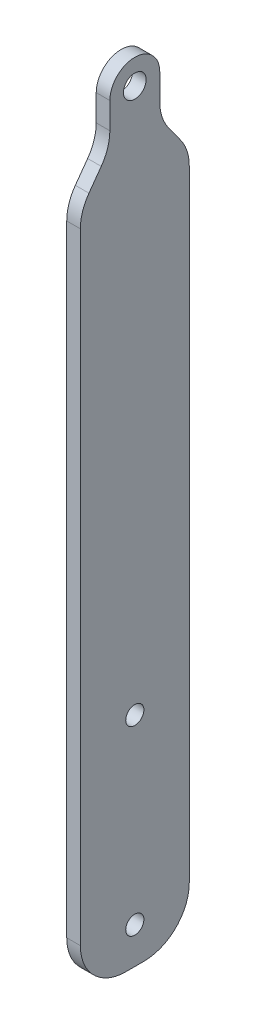
ISO-10303-21;
HEADER;
FILE_DESCRIPTION(('STEP AP214'),'2;1');
FILE_NAME('part.step','',(''),(''),'','','');
FILE_SCHEMA(('AUTOMOTIVE_DESIGN { 1 0 10303 214 1 1 1 1 }'));
ENDSEC;
DATA;
#1=APPLICATION_CONTEXT('core data for automotive mechanical design processes');
#2=APPLICATION_PROTOCOL_DEFINITION('international standard','automotive_design',2000,#1);
#3=PRODUCT_CONTEXT('',#1,'mechanical');
#4=PRODUCT('Part','Part','',(#3));
#5=PRODUCT_RELATED_PRODUCT_CATEGORY('part','',(#4));
#6=PRODUCT_DEFINITION_FORMATION('','',#4);
#7=PRODUCT_DEFINITION_CONTEXT('part definition',#1,'design');
#8=PRODUCT_DEFINITION('design','',#6,#7);
#9=PRODUCT_DEFINITION_SHAPE('','',#8);
#10=(LENGTH_UNIT() NAMED_UNIT(*) SI_UNIT(.MILLI.,.METRE.));
#11=(NAMED_UNIT(*) PLANE_ANGLE_UNIT() SI_UNIT($,.RADIAN.));
#12=(NAMED_UNIT(*) SI_UNIT($,.STERADIAN.) SOLID_ANGLE_UNIT());
#13=UNCERTAINTY_MEASURE_WITH_UNIT(LENGTH_MEASURE(1.E-05),#10,'distance_accuracy_value','');
#14=(GEOMETRIC_REPRESENTATION_CONTEXT(3) GLOBAL_UNCERTAINTY_ASSIGNED_CONTEXT((#13)) GLOBAL_UNIT_ASSIGNED_CONTEXT((#10,
#11,#12)) REPRESENTATION_CONTEXT('',''));
#15=CARTESIAN_POINT('',(0.,0.,0.));
#16=DIRECTION('',(0.,0.,1.));
#17=DIRECTION('',(1.,0.,0.));
#18=AXIS2_PLACEMENT_3D('',#15,#16,#17);
#19=CARTESIAN_POINT('',(21.3,-7.35394608612762,-67.));
#20=DIRECTION('',(-1.,0.,0.));
#21=DIRECTION('',(0.,0.,1.));
#22=AXIS2_PLACEMENT_3D('',#19,#20,#21);
#23=PLANE('',#22);
#24=CARTESIAN_POINT('',(21.3,-127.353946086128,-67.));
#25=DIRECTION('',(-1.,0.,0.));
#26=DIRECTION('',(0.,0.,1.));
#27=AXIS2_PLACEMENT_3D('',#24,#25,#26);
#28=CIRCLE('',#27,2.);
#29=CARTESIAN_POINT('',(21.3,-127.353946086128,-65.));
#30=VERTEX_POINT('',#29);
#31=EDGE_CURVE('E361',#30,#30,#28,.T.);
#32=ORIENTED_EDGE('',*,*,#31,.T.);
#33=EDGE_LOOP('',(#32));
#34=FACE_BOUND('',#33,.T.);
#35=CARTESIAN_POINT('',(21.3,-167.353946086128,-67.));
#36=DIRECTION('',(-1.,0.,0.));
#37=DIRECTION('',(0.,0.,1.));
#38=AXIS2_PLACEMENT_3D('',#35,#36,#37);
#39=CIRCLE('',#38,2.);
#40=CARTESIAN_POINT('',(21.3,-167.353946086128,-65.));
#41=VERTEX_POINT('',#40);
#42=EDGE_CURVE('E369',#41,#41,#39,.T.);
#43=ORIENTED_EDGE('',*,*,#42,.T.);
#44=EDGE_LOOP('',(#43));
#45=FACE_BOUND('',#44,.T.);
#46=DIRECTION('',(0.,0.,-1.));
#47=VECTOR('',#46,1.);
#48=CARTESIAN_POINT('',(21.3,-175.353946086128,-79.));
#49=LINE('',#48,#47);
#50=CARTESIAN_POINT('',(21.3,-175.353946086128,-65.));
#51=VERTEX_POINT('',#50);
#52=CARTESIAN_POINT('',(21.3,-175.353946086128,-69.));
#53=VERTEX_POINT('',#52);
#54=EDGE_CURVE('E208',#51,#53,#49,.T.);
#55=ORIENTED_EDGE('',*,*,#54,.T.);
#56=CARTESIAN_POINT('',(21.3,-165.353946086128,-69.));
#57=DIRECTION('',(-1.,0.,0.));
#58=DIRECTION('',(0.,0.,1.));
#59=AXIS2_PLACEMENT_3D('',#56,#57,#58);
#60=CIRCLE('',#59,10.);
#61=CARTESIAN_POINT('',(21.3,-165.353946086128,-79.));
#62=VERTEX_POINT('',#61);
#63=EDGE_CURVE('E270',#53,#62,#60,.F.);
#64=ORIENTED_EDGE('',*,*,#63,.T.);
#65=DIRECTION('',(0.,1.,0.));
#66=VECTOR('',#65,1.);
#67=CARTESIAN_POINT('',(21.3,-25.3539460861276,-79.));
#68=LINE('',#67,#66);
#69=CARTESIAN_POINT('',(21.3,-28.5874870947234,-79.));
#70=VERTEX_POINT('',#69);
#71=EDGE_CURVE('E211',#62,#70,#68,.T.);
#72=ORIENTED_EDGE('',*,*,#71,.T.);
#73=CARTESIAN_POINT('',(21.3,-28.5874870947234,-69.));
#74=DIRECTION('',(-1.,0.,0.));
#75=DIRECTION('',(0.,0.,1.));
#76=AXIS2_PLACEMENT_3D('',#73,#74,#75);
#77=CIRCLE('',#76,10.);
#78=CARTESIAN_POINT('',(21.3,-22.7325815562798,-77.1067922839988));
#79=VERTEX_POINT('',#78);
#80=EDGE_CURVE('E264',#70,#79,#77,.F.);
#81=ORIENTED_EDGE('',*,*,#80,.T.);
#82=DIRECTION('',(0.,0.810679228399881,0.585490553844358));
#83=VECTOR('',#82,1.);
#84=CARTESIAN_POINT('',(21.3,-16.3539460861276,-72.5));
#85=LINE('',#84,#83);
#86=CARTESIAN_POINT('',(21.3,-18.9753106159754,-74.3932077160012));
#87=VERTEX_POINT('',#86);
#88=EDGE_CURVE('E214',#79,#87,#85,.T.);
#89=ORIENTED_EDGE('',*,*,#88,.T.);
#90=CARTESIAN_POINT('',(21.3,-13.1204050775318,-82.5));
#91=DIRECTION('',(-1.,0.,0.));
#92=DIRECTION('',(0.,0.,1.));
#93=AXIS2_PLACEMENT_3D('',#90,#91,#92);
#94=CIRCLE('',#93,10.);
#95=CARTESIAN_POINT('',(21.3,-13.1204050775318,-72.5));
#96=VERTEX_POINT('',#95);
#97=EDGE_CURVE('E11',#87,#96,#94,.T.);
#98=ORIENTED_EDGE('',*,*,#97,.T.);
#99=DIRECTION('',(0.,1.,0.));
#100=VECTOR('',#99,1.);
#101=CARTESIAN_POINT('',(21.3,-7.35394608612762,-72.5));
#102=LINE('',#101,#100);
#103=CARTESIAN_POINT('',(21.3,-7.35394608612762,-72.5));
#104=VERTEX_POINT('',#103);
#105=EDGE_CURVE('E216',#96,#104,#102,.T.);
#106=ORIENTED_EDGE('',*,*,#105,.T.);
#107=CARTESIAN_POINT('',(21.3,-7.35394608612762,-67.));
#108=DIRECTION('',(1.,0.,0.));
#109=DIRECTION('',(0.,0.,1.));
#110=AXIS2_PLACEMENT_3D('',#107,#108,#109);
#111=CIRCLE('',#110,5.50000000000001);
#112=CARTESIAN_POINT('',(21.3,-7.35394608612762,-61.5));
#113=VERTEX_POINT('',#112);
#114=EDGE_CURVE('E195',#104,#113,#111,.T.);
#115=ORIENTED_EDGE('',*,*,#114,.T.);
#116=DIRECTION('',(0.,-1.,0.));
#117=VECTOR('',#116,1.);
#118=CARTESIAN_POINT('',(21.3,-7.35394608612762,-61.5));
#119=LINE('',#118,#117);
#120=CARTESIAN_POINT('',(21.3,-13.1204050775318,-61.5));
#121=VERTEX_POINT('',#120);
#122=EDGE_CURVE('E198',#113,#121,#119,.T.);
#123=ORIENTED_EDGE('',*,*,#122,.T.);
#124=CARTESIAN_POINT('',(21.3,-13.1204050775318,-51.5));
#125=DIRECTION('',(-1.,0.,0.));
#126=DIRECTION('',(0.,0.,1.));
#127=AXIS2_PLACEMENT_3D('',#124,#125,#126);
#128=CIRCLE('',#127,10.);
#129=CARTESIAN_POINT('',(21.3,-18.9753106159754,-59.6067922839988));
#130=VERTEX_POINT('',#129);
#131=EDGE_CURVE('E295',#121,#130,#128,.T.);
#132=ORIENTED_EDGE('',*,*,#131,.T.);
#133=DIRECTION('',(0.,-0.810679228399881,0.585490553844358));
#134=VECTOR('',#133,1.);
#135=CARTESIAN_POINT('',(21.3,-16.3539460861276,-61.5));
#136=LINE('',#135,#134);
#137=CARTESIAN_POINT('',(21.3,-22.7325815562798,-56.8932077160012));
#138=VERTEX_POINT('',#137);
#139=EDGE_CURVE('E202',#130,#138,#136,.T.);
#140=ORIENTED_EDGE('',*,*,#139,.T.);
#141=CARTESIAN_POINT('',(21.3,-28.5874870947234,-65.));
#142=DIRECTION('',(-1.,0.,0.));
#143=DIRECTION('',(0.,0.,1.));
#144=AXIS2_PLACEMENT_3D('',#141,#142,#143);
#145=CIRCLE('',#144,10.);
#146=CARTESIAN_POINT('',(21.3,-28.5874870947234,-55.));
#147=VERTEX_POINT('',#146);
#148=EDGE_CURVE('E266',#138,#147,#145,.F.);
#149=ORIENTED_EDGE('',*,*,#148,.T.);
#150=DIRECTION('',(0.,-1.,0.));
#151=VECTOR('',#150,1.);
#152=CARTESIAN_POINT('',(21.3,-175.353946086128,-55.));
#153=LINE('',#152,#151);
#154=CARTESIAN_POINT('',(21.3,-165.353946086128,-55.));
#155=VERTEX_POINT('',#154);
#156=EDGE_CURVE('E205',#147,#155,#153,.T.);
#157=ORIENTED_EDGE('',*,*,#156,.T.);
#158=CARTESIAN_POINT('',(21.3,-165.353946086128,-65.));
#159=DIRECTION('',(-1.,0.,0.));
#160=DIRECTION('',(0.,0.,1.));
#161=AXIS2_PLACEMENT_3D('',#158,#159,#160);
#162=CIRCLE('',#161,10.);
#163=EDGE_CURVE('E268',#155,#51,#162,.F.);
#164=ORIENTED_EDGE('',*,*,#163,.T.);
#165=EDGE_LOOP('',(#55,#64,#72,#81,#89,#98,#106,#115,#123,#132,#140,#149,#157,#164));
#166=FACE_BOUND('',#165,.T.);
#167=CARTESIAN_POINT('',(21.3,-7.35394608612762,-67.));
#168=DIRECTION('',(1.,0.,0.));
#169=DIRECTION('',(0.,0.,-1.));
#170=AXIS2_PLACEMENT_3D('',#167,#168,#169);
#171=CIRCLE('',#170,2.5);
#172=CARTESIAN_POINT('',(21.3,-7.35394608612762,-69.5));
#173=VERTEX_POINT('',#172);
#174=EDGE_CURVE('E187',#173,#173,#171,.T.);
#175=ORIENTED_EDGE('',*,*,#174,.F.);
#176=EDGE_LOOP('',(#175));
#177=FACE_BOUND('',#176,.T.);
#178=ADVANCED_FACE('F32',(#34,#45,#166,#177),#23,.F.);
#179=CARTESIAN_POINT('',(18.3,-7.35394608612762,-67.));
#180=DIRECTION('',(-1.,0.,0.));
#181=DIRECTION('',(0.,0.,1.));
#182=AXIS2_PLACEMENT_3D('',#179,#180,#181);
#183=PLANE('',#182);
#184=DIRECTION('',(0.,1.,0.));
#185=VECTOR('',#184,1.);
#186=CARTESIAN_POINT('',(18.3,-25.3539460861276,-79.));
#187=LINE('',#186,#185);
#188=CARTESIAN_POINT('',(18.3,-165.353946086128,-79.));
#189=VERTEX_POINT('',#188);
#190=CARTESIAN_POINT('',(18.3,-28.5874870947234,-79.));
#191=VERTEX_POINT('',#190);
#192=EDGE_CURVE('E230',#189,#191,#187,.T.);
#193=ORIENTED_EDGE('',*,*,#192,.F.);
#194=CARTESIAN_POINT('',(18.3,-165.353946086128,-69.));
#195=DIRECTION('',(-1.,0.,0.));
#196=DIRECTION('',(0.,0.,1.));
#197=AXIS2_PLACEMENT_3D('',#194,#195,#196);
#198=CIRCLE('',#197,10.);
#199=CARTESIAN_POINT('',(18.3,-173.383353838012,-74.9605881550377));
#200=VERTEX_POINT('',#199);
#201=EDGE_CURVE('E252',#189,#200,#198,.T.);
#202=ORIENTED_EDGE('',*,*,#201,.T.);
#203=DIRECTION('',(0.,-0.999800059980007,-0.0199960011996002));
#204=VECTOR('',#203,1.);
#205=CARTESIAN_POINT('',(18.3,-25.3539460861276,-72.));
#206=LINE('',#205,#204);
#207=CARTESIAN_POINT('',(18.3,-25.3539460861276,-72.));
#208=VERTEX_POINT('',#207);
#209=EDGE_CURVE('E359',#208,#200,#206,.T.);
#210=ORIENTED_EDGE('',*,*,#209,.F.);
#211=CARTESIAN_POINT('',(18.3,-25.3539460861276,-67.));
#212=DIRECTION('',(-1.,0.,0.));
#213=DIRECTION('',(0.,0.,-1.));
#214=AXIS2_PLACEMENT_3D('',#211,#212,#213);
#215=CIRCLE('',#214,5.);
#216=CARTESIAN_POINT('',(18.3,-25.3539460861276,-62.));
#217=VERTEX_POINT('',#216);
#218=EDGE_CURVE('E182',#217,#208,#215,.T.);
#219=ORIENTED_EDGE('',*,*,#218,.F.);
#220=DIRECTION('',(0.,0.999800059980007,-0.0199960011996002));
#221=VECTOR('',#220,1.);
#222=CARTESIAN_POINT('',(18.3,-25.3539460861276,-62.));
#223=LINE('',#222,#221);
#224=CARTESIAN_POINT('',(18.3,-173.383353838012,-59.0394118449623));
#225=VERTEX_POINT('',#224);
#226=EDGE_CURVE('E178',#225,#217,#223,.T.);
#227=ORIENTED_EDGE('',*,*,#226,.F.);
#228=CARTESIAN_POINT('',(18.3,-165.353946086128,-65.));
#229=DIRECTION('',(-1.,0.,0.));
#230=DIRECTION('',(0.,0.,1.));
#231=AXIS2_PLACEMENT_3D('',#228,#229,#230);
#232=CIRCLE('',#231,10.);
#233=CARTESIAN_POINT('',(18.3,-165.353946086128,-55.));
#234=VERTEX_POINT('',#233);
#235=EDGE_CURVE('E250',#225,#234,#232,.T.);
#236=ORIENTED_EDGE('',*,*,#235,.T.);
#237=DIRECTION('',(0.,-1.,0.));
#238=VECTOR('',#237,1.);
#239=CARTESIAN_POINT('',(18.3,-175.353946086128,-55.));
#240=LINE('',#239,#238);
#241=CARTESIAN_POINT('',(18.3,-28.5874870947234,-55.));
#242=VERTEX_POINT('',#241);
#243=EDGE_CURVE('E227',#242,#234,#240,.T.);
#244=ORIENTED_EDGE('',*,*,#243,.F.);
#245=CARTESIAN_POINT('',(18.3,-28.5874870947234,-65.));
#246=DIRECTION('',(-1.,0.,0.));
#247=DIRECTION('',(0.,0.,1.));
#248=AXIS2_PLACEMENT_3D('',#245,#246,#247);
#249=CIRCLE('',#248,10.);
#250=CARTESIAN_POINT('',(18.3,-22.7325815562798,-56.8932077160012));
#251=VERTEX_POINT('',#250);
#252=EDGE_CURVE('E248',#242,#251,#249,.T.);
#253=ORIENTED_EDGE('',*,*,#252,.T.);
#254=DIRECTION('',(0.,-0.810679228399881,0.585490553844358));
#255=VECTOR('',#254,1.);
#256=CARTESIAN_POINT('',(18.3,-16.3539460861276,-61.5));
#257=LINE('',#256,#255);
#258=CARTESIAN_POINT('',(18.3,-18.9753106159754,-59.6067922839988));
#259=VERTEX_POINT('',#258);
#260=EDGE_CURVE('E224',#259,#251,#257,.T.);
#261=ORIENTED_EDGE('',*,*,#260,.F.);
#262=CARTESIAN_POINT('',(18.3,-13.1204050775318,-51.5));
#263=DIRECTION('',(-1.,0.,0.));
#264=DIRECTION('',(0.,0.,1.));
#265=AXIS2_PLACEMENT_3D('',#262,#263,#264);
#266=CIRCLE('',#265,10.);
#267=CARTESIAN_POINT('',(18.3,-13.1204050775318,-61.5));
#268=VERTEX_POINT('',#267);
#269=EDGE_CURVE('E293',#259,#268,#266,.F.);
#270=ORIENTED_EDGE('',*,*,#269,.T.);
#271=DIRECTION('',(0.,-1.,0.));
#272=VECTOR('',#271,1.);
#273=CARTESIAN_POINT('',(18.3,-7.35394608612762,-61.5));
#274=LINE('',#273,#272);
#275=CARTESIAN_POINT('',(18.3,-7.35394608612762,-61.5));
#276=VERTEX_POINT('',#275);
#277=EDGE_CURVE('E221',#276,#268,#274,.T.);
#278=ORIENTED_EDGE('',*,*,#277,.F.);
#279=CARTESIAN_POINT('',(18.3,-7.35394608612762,-67.));
#280=DIRECTION('',(1.,0.,0.));
#281=DIRECTION('',(0.,0.,1.));
#282=AXIS2_PLACEMENT_3D('',#279,#280,#281);
#283=CIRCLE('',#282,5.50000000000001);
#284=CARTESIAN_POINT('',(18.3,-7.35394608612762,-72.5));
#285=VERTEX_POINT('',#284);
#286=EDGE_CURVE('E193',#285,#276,#283,.T.);
#287=ORIENTED_EDGE('',*,*,#286,.F.);
#288=DIRECTION('',(0.,1.,0.));
#289=VECTOR('',#288,1.);
#290=CARTESIAN_POINT('',(18.3,-7.35394608612762,-72.5));
#291=LINE('',#290,#289);
#292=CARTESIAN_POINT('',(18.3,-13.1204050775318,-72.5));
#293=VERTEX_POINT('',#292);
#294=EDGE_CURVE('E199',#293,#285,#291,.T.);
#295=ORIENTED_EDGE('',*,*,#294,.F.);
#296=CARTESIAN_POINT('',(18.3,-13.1204050775318,-82.5));
#297=DIRECTION('',(-1.,0.,0.));
#298=DIRECTION('',(0.,0.,1.));
#299=AXIS2_PLACEMENT_3D('',#296,#297,#298);
#300=CIRCLE('',#299,10.);
#301=CARTESIAN_POINT('',(18.3,-18.9753106159754,-74.3932077160012));
#302=VERTEX_POINT('',#301);
#303=EDGE_CURVE('E40',#293,#302,#300,.F.);
#304=ORIENTED_EDGE('',*,*,#303,.T.);
#305=DIRECTION('',(0.,0.810679228399881,0.585490553844358));
#306=VECTOR('',#305,1.);
#307=CARTESIAN_POINT('',(18.3,-16.3539460861276,-72.5));
#308=LINE('',#307,#306);
#309=CARTESIAN_POINT('',(18.3,-22.7325815562798,-77.1067922839988));
#310=VERTEX_POINT('',#309);
#311=EDGE_CURVE('E233',#310,#302,#308,.T.);
#312=ORIENTED_EDGE('',*,*,#311,.F.);
#313=CARTESIAN_POINT('',(18.3,-28.5874870947234,-69.));
#314=DIRECTION('',(-1.,0.,0.));
#315=DIRECTION('',(0.,0.,1.));
#316=AXIS2_PLACEMENT_3D('',#313,#314,#315);
#317=CIRCLE('',#316,10.);
#318=EDGE_CURVE('E246',#310,#191,#317,.T.);
#319=ORIENTED_EDGE('',*,*,#318,.T.);
#320=EDGE_LOOP('',(#193,#202,#210,#219,#227,#236,#244,#253,#261,#270,#278,#287,#295,#304,#312,#319));
#321=FACE_BOUND('',#320,.T.);
#322=CARTESIAN_POINT('',(18.3,-7.35394608612762,-67.));
#323=DIRECTION('',(1.,0.,0.));
#324=DIRECTION('',(0.,0.,-1.));
#325=AXIS2_PLACEMENT_3D('',#322,#323,#324);
#326=CIRCLE('',#325,2.5);
#327=CARTESIAN_POINT('',(18.3,-7.35394608612762,-69.5));
#328=VERTEX_POINT('',#327);
#329=EDGE_CURVE('E183',#328,#328,#326,.T.);
#330=ORIENTED_EDGE('',*,*,#329,.T.);
#331=EDGE_LOOP('',(#330));
#332=FACE_BOUND('',#331,.T.);
#333=ADVANCED_FACE('F300',(#321,#332),#183,.T.);
#334=CARTESIAN_POINT('',(21.3,-7.35394608612762,-67.));
#335=DIRECTION('',(-1.,0.,0.));
#336=DIRECTION('',(0.,0.,1.));
#337=AXIS2_PLACEMENT_3D('',#334,#335,#336);
#338=CYLINDRICAL_SURFACE('',#337,5.50000000000001);
#339=ORIENTED_EDGE('',*,*,#286,.T.);
#340=DIRECTION('',(-1.,0.,0.));
#341=VECTOR('',#340,1.);
#342=CARTESIAN_POINT('',(21.3,-7.35394608612762,-61.5));
#343=LINE('',#342,#341);
#344=EDGE_CURVE('E238',#113,#276,#343,.T.);
#345=ORIENTED_EDGE('',*,*,#344,.F.);
#346=ORIENTED_EDGE('',*,*,#114,.F.);
#347=DIRECTION('',(-1.,0.,0.));
#348=VECTOR('',#347,1.);
#349=CARTESIAN_POINT('',(21.3,-7.35394608612762,-72.5));
#350=LINE('',#349,#348);
#351=EDGE_CURVE('E218',#104,#285,#350,.T.);
#352=ORIENTED_EDGE('',*,*,#351,.T.);
#353=EDGE_LOOP('',(#339,#345,#346,#352));
#354=FACE_BOUND('',#353,.T.);
#355=ADVANCED_FACE('F315',(#354),#338,.T.);
#356=CARTESIAN_POINT('',(21.3,-7.35394608612762,-61.5));
#357=DIRECTION('',(0.,0.,-1.));
#358=DIRECTION('',(-1.,0.,0.));
#359=AXIS2_PLACEMENT_3D('',#356,#357,#358);
#360=PLANE('',#359);
#361=ORIENTED_EDGE('',*,*,#277,.T.);
#362=DIRECTION('',(-1.,0.,0.));
#363=VECTOR('',#362,1.);
#364=CARTESIAN_POINT('',(21.3,-13.1204050775318,-61.5));
#365=LINE('',#364,#363);
#366=EDGE_CURVE('E284',#268,#121,#365,.F.);
#367=ORIENTED_EDGE('',*,*,#366,.T.);
#368=ORIENTED_EDGE('',*,*,#122,.F.);
#369=ORIENTED_EDGE('',*,*,#344,.T.);
#370=EDGE_LOOP('',(#361,#367,#368,#369));
#371=FACE_BOUND('',#370,.T.);
#372=ADVANCED_FACE('F317',(#371),#360,.F.);
#373=CARTESIAN_POINT('',(21.3,-16.3539460861276,-61.5));
#374=DIRECTION('',(0.,-0.585490553844358,-0.810679228399881));
#375=DIRECTION('',(0.,0.810679228399881,-0.585490553844358));
#376=AXIS2_PLACEMENT_3D('',#373,#374,#375);
#377=PLANE('',#376);
#378=ORIENTED_EDGE('',*,*,#260,.T.);
#379=DIRECTION('',(-1.,0.,0.));
#380=VECTOR('',#379,1.);
#381=CARTESIAN_POINT('',(21.3,-22.7325815562798,-56.8932077160012));
#382=LINE('',#381,#380);
#383=EDGE_CURVE('E282',#251,#138,#382,.F.);
#384=ORIENTED_EDGE('',*,*,#383,.T.);
#385=ORIENTED_EDGE('',*,*,#139,.F.);
#386=DIRECTION('',(-1.,0.,0.));
#387=VECTOR('',#386,1.);
#388=CARTESIAN_POINT('',(18.3,-18.9753106159754,-59.6067922839988));
#389=LINE('',#388,#387);
#390=EDGE_CURVE('E279',#130,#259,#389,.T.);
#391=ORIENTED_EDGE('',*,*,#390,.T.);
#392=EDGE_LOOP('',(#378,#384,#385,#391));
#393=FACE_BOUND('',#392,.T.);
#394=ADVANCED_FACE('F325',(#393),#377,.F.);
#395=CARTESIAN_POINT('',(21.3,-175.353946086128,-55.));
#396=DIRECTION('',(0.,0.,-1.));
#397=DIRECTION('',(-1.,0.,0.));
#398=AXIS2_PLACEMENT_3D('',#395,#396,#397);
#399=PLANE('',#398);
#400=ORIENTED_EDGE('',*,*,#243,.T.);
#401=DIRECTION('',(-1.,0.,0.));
#402=VECTOR('',#401,1.);
#403=CARTESIAN_POINT('',(21.3,-165.353946086128,-55.));
#404=LINE('',#403,#402);
#405=EDGE_CURVE('E277',#234,#155,#404,.F.);
#406=ORIENTED_EDGE('',*,*,#405,.T.);
#407=ORIENTED_EDGE('',*,*,#156,.F.);
#408=DIRECTION('',(-1.,0.,0.));
#409=VECTOR('',#408,1.);
#410=CARTESIAN_POINT('',(21.3,-28.5874870947234,-55.));
#411=LINE('',#410,#409);
#412=EDGE_CURVE('E274',#147,#242,#411,.T.);
#413=ORIENTED_EDGE('',*,*,#412,.T.);
#414=EDGE_LOOP('',(#400,#406,#407,#413));
#415=FACE_BOUND('',#414,.T.);
#416=ADVANCED_FACE('F334',(#415),#399,.F.);
#417=CARTESIAN_POINT('',(21.3,-175.353946086128,-79.));
#418=DIRECTION('',(0.,1.,0.));
#419=DIRECTION('',(0.,0.,1.));
#420=AXIS2_PLACEMENT_3D('',#417,#418,#419);
#421=PLANE('',#420);
#422=DIRECTION('',(0.,0.,1.));
#423=VECTOR('',#422,1.);
#424=CARTESIAN_POINT('',(16.3,-175.353946086128,-75.));
#425=LINE('',#424,#423);
#426=CARTESIAN_POINT('',(16.3,-175.353946086128,-69.));
#427=VERTEX_POINT('',#426);
#428=CARTESIAN_POINT('',(16.3,-175.353946086128,-65.));
#429=VERTEX_POINT('',#428);
#430=EDGE_CURVE('E168',#427,#429,#425,.T.);
#431=ORIENTED_EDGE('',*,*,#430,.F.);
#432=DIRECTION('',(-1.,0.,0.));
#433=VECTOR('',#432,1.);
#434=CARTESIAN_POINT('',(21.3,-175.353946086128,-69.));
#435=LINE('',#434,#433);
#436=EDGE_CURVE('E262',#427,#53,#435,.F.);
#437=ORIENTED_EDGE('',*,*,#436,.T.);
#438=ORIENTED_EDGE('',*,*,#54,.F.);
#439=DIRECTION('',(-1.,0.,0.));
#440=VECTOR('',#439,1.);
#441=CARTESIAN_POINT('',(21.3,-175.353946086128,-65.));
#442=LINE('',#441,#440);
#443=EDGE_CURVE('E259',#51,#429,#442,.T.);
#444=ORIENTED_EDGE('',*,*,#443,.T.);
#445=EDGE_LOOP('',(#431,#437,#438,#444));
#446=FACE_BOUND('',#445,.T.);
#447=ADVANCED_FACE('F346',(#446),#421,.F.);
#448=CARTESIAN_POINT('',(21.3,-25.3539460861276,-79.));
#449=DIRECTION('',(0.,0.,1.));
#450=DIRECTION('',(1.,0.,0.));
#451=AXIS2_PLACEMENT_3D('',#448,#449,#450);
#452=PLANE('',#451);
#453=ORIENTED_EDGE('',*,*,#71,.F.);
#454=DIRECTION('',(-1.,0.,0.));
#455=VECTOR('',#454,1.);
#456=CARTESIAN_POINT('',(21.3,-165.353946086128,-79.));
#457=LINE('',#456,#455);
#458=EDGE_CURVE('E243',#62,#189,#457,.T.);
#459=ORIENTED_EDGE('',*,*,#458,.T.);
#460=ORIENTED_EDGE('',*,*,#192,.T.);
#461=DIRECTION('',(-1.,0.,0.));
#462=VECTOR('',#461,1.);
#463=CARTESIAN_POINT('',(21.3,-28.5874870947234,-79.));
#464=LINE('',#463,#462);
#465=EDGE_CURVE('E241',#191,#70,#464,.F.);
#466=ORIENTED_EDGE('',*,*,#465,.T.);
#467=EDGE_LOOP('',(#453,#459,#460,#466));
#468=FACE_BOUND('',#467,.T.);
#469=ADVANCED_FACE('F355',(#468),#452,.F.);
#470=CARTESIAN_POINT('',(21.3,-16.3539460861276,-72.5));
#471=DIRECTION('',(0.,-0.585490553844358,0.810679228399881));
#472=DIRECTION('',(0.,-0.810679228399881,-0.585490553844358));
#473=AXIS2_PLACEMENT_3D('',#470,#471,#472);
#474=PLANE('',#473);
#475=ORIENTED_EDGE('',*,*,#88,.F.);
#476=DIRECTION('',(-1.,0.,0.));
#477=VECTOR('',#476,1.);
#478=CARTESIAN_POINT('',(21.3,-22.7325815562798,-77.1067922839988));
#479=LINE('',#478,#477);
#480=EDGE_CURVE('E287',#79,#310,#479,.T.);
#481=ORIENTED_EDGE('',*,*,#480,.T.);
#482=ORIENTED_EDGE('',*,*,#311,.T.);
#483=DIRECTION('',(-1.,0.,0.));
#484=VECTOR('',#483,1.);
#485=CARTESIAN_POINT('',(21.3,-18.9753106159754,-74.3932077160012));
#486=LINE('',#485,#484);
#487=EDGE_CURVE('E53',#302,#87,#486,.F.);
#488=ORIENTED_EDGE('',*,*,#487,.T.);
#489=EDGE_LOOP('',(#475,#481,#482,#488));
#490=FACE_BOUND('',#489,.T.);
#491=ADVANCED_FACE('F305',(#490),#474,.F.);
#492=CARTESIAN_POINT('',(21.3,-7.35394608612762,-72.5));
#493=DIRECTION('',(0.,0.,1.));
#494=DIRECTION('',(1.,0.,0.));
#495=AXIS2_PLACEMENT_3D('',#492,#493,#494);
#496=PLANE('',#495);
#497=ORIENTED_EDGE('',*,*,#105,.F.);
#498=DIRECTION('',(-1.,0.,0.));
#499=VECTOR('',#498,1.);
#500=CARTESIAN_POINT('',(18.3,-13.1204050775318,-72.5));
#501=LINE('',#500,#499);
#502=EDGE_CURVE('E290',#96,#293,#501,.T.);
#503=ORIENTED_EDGE('',*,*,#502,.T.);
#504=ORIENTED_EDGE('',*,*,#294,.T.);
#505=ORIENTED_EDGE('',*,*,#351,.F.);
#506=EDGE_LOOP('',(#497,#503,#504,#505));
#507=FACE_BOUND('',#506,.T.);
#508=ADVANCED_FACE('F308',(#507),#496,.F.);
#509=CARTESIAN_POINT('',(21.3,-7.35394608612762,-67.));
#510=DIRECTION('',(-1.,0.,0.));
#511=DIRECTION('',(0.,0.,1.));
#512=AXIS2_PLACEMENT_3D('',#509,#510,#511);
#513=CYLINDRICAL_SURFACE('',#512,2.5);
#514=ORIENTED_EDGE('',*,*,#174,.T.);
#515=EDGE_LOOP('',(#514));
#516=FACE_BOUND('',#515,.T.);
#517=ORIENTED_EDGE('',*,*,#329,.F.);
#518=EDGE_LOOP('',(#517));
#519=FACE_BOUND('',#518,.T.);
#520=ADVANCED_FACE('F407',(#516,#519),#513,.F.);
#521=CARTESIAN_POINT('',(16.3,-25.3539460861276,-67.));
#522=DIRECTION('',(1.,0.,0.));
#523=DIRECTION('',(0.,0.,-1.));
#524=AXIS2_PLACEMENT_3D('',#521,#522,#523);
#525=CYLINDRICAL_SURFACE('',#524,5.);
#526=ORIENTED_EDGE('',*,*,#218,.T.);
#527=DIRECTION('',(1.,0.,0.));
#528=VECTOR('',#527,1.);
#529=CARTESIAN_POINT('',(16.3,-25.3539460861276,-72.));
#530=LINE('',#529,#528);
#531=CARTESIAN_POINT('',(16.3,-25.3539460861276,-72.));
#532=VERTEX_POINT('',#531);
#533=EDGE_CURVE('E162',#532,#208,#530,.T.);
#534=ORIENTED_EDGE('',*,*,#533,.F.);
#535=CARTESIAN_POINT('',(16.3,-25.3539460861276,-67.));
#536=DIRECTION('',(-1.,0.,0.));
#537=DIRECTION('',(0.,0.,-1.));
#538=AXIS2_PLACEMENT_3D('',#535,#536,#537);
#539=CIRCLE('',#538,5.);
#540=CARTESIAN_POINT('',(16.3,-25.3539460861276,-62.));
#541=VERTEX_POINT('',#540);
#542=EDGE_CURVE('E169',#541,#532,#539,.T.);
#543=ORIENTED_EDGE('',*,*,#542,.F.);
#544=DIRECTION('',(1.,0.,0.));
#545=VECTOR('',#544,1.);
#546=CARTESIAN_POINT('',(16.3,-25.3539460861276,-62.));
#547=LINE('',#546,#545);
#548=EDGE_CURVE('E184',#541,#217,#547,.T.);
#549=ORIENTED_EDGE('',*,*,#548,.T.);
#550=EDGE_LOOP('',(#526,#534,#543,#549));
#551=FACE_BOUND('',#550,.T.);
#552=ADVANCED_FACE('F180',(#551),#525,.T.);
#553=CARTESIAN_POINT('',(16.3,-25.3539460861276,-72.));
#554=DIRECTION('',(0.,-0.0199960011996002,0.999800059980007));
#555=DIRECTION('',(0.,-0.999800059980007,-0.0199960011996002));
#556=AXIS2_PLACEMENT_3D('',#553,#554,#555);
#557=PLANE('',#556);
#558=ORIENTED_EDGE('',*,*,#209,.T.);
#559=DIRECTION('',(-1.,0.,0.));
#560=VECTOR('',#559,1.);
#561=CARTESIAN_POINT('',(18.3,-173.383353838012,-74.9605881550377));
#562=LINE('',#561,#560);
#563=CARTESIAN_POINT('',(16.3,-173.383353838012,-74.9605881550377));
#564=VERTEX_POINT('',#563);
#565=EDGE_CURVE('E165',#200,#564,#562,.T.);
#566=ORIENTED_EDGE('',*,*,#565,.T.);
#567=DIRECTION('',(0.,-0.999800059980007,-0.0199960011996002));
#568=VECTOR('',#567,1.);
#569=CARTESIAN_POINT('',(16.3,-25.3539460861276,-72.));
#570=LINE('',#569,#568);
#571=EDGE_CURVE('E157',#532,#564,#570,.T.);
#572=ORIENTED_EDGE('',*,*,#571,.F.);
#573=ORIENTED_EDGE('',*,*,#533,.T.);
#574=EDGE_LOOP('',(#558,#566,#572,#573));
#575=FACE_BOUND('',#574,.T.);
#576=ADVANCED_FACE('F160',(#575),#557,.F.);
#577=CARTESIAN_POINT('',(16.3,-25.3539460861276,-62.));
#578=DIRECTION('',(0.,-0.0199960011996002,-0.999800059980007));
#579=DIRECTION('',(0.,0.999800059980007,-0.0199960011996002));
#580=AXIS2_PLACEMENT_3D('',#577,#578,#579);
#581=PLANE('',#580);
#582=DIRECTION('',(0.,0.999800059980007,-0.0199960011996002));
#583=VECTOR('',#582,1.);
#584=CARTESIAN_POINT('',(16.3,-25.3539460861276,-62.));
#585=LINE('',#584,#583);
#586=CARTESIAN_POINT('',(16.3,-173.383353838012,-59.0394118449623));
#587=VERTEX_POINT('',#586);
#588=EDGE_CURVE('E174',#587,#541,#585,.T.);
#589=ORIENTED_EDGE('',*,*,#588,.F.);
#590=DIRECTION('',(-1.,0.,0.));
#591=VECTOR('',#590,1.);
#592=CARTESIAN_POINT('',(16.3,-173.383353838012,-59.0394118449623));
#593=LINE('',#592,#591);
#594=EDGE_CURVE('E272',#587,#225,#593,.F.);
#595=ORIENTED_EDGE('',*,*,#594,.T.);
#596=ORIENTED_EDGE('',*,*,#226,.T.);
#597=ORIENTED_EDGE('',*,*,#548,.F.);
#598=EDGE_LOOP('',(#589,#595,#596,#597));
#599=FACE_BOUND('',#598,.T.);
#600=ADVANCED_FACE('F389',(#599),#581,.F.);
#601=CARTESIAN_POINT('',(16.3,-25.3539460861276,-67.));
#602=DIRECTION('',(1.,0.,0.));
#603=DIRECTION('',(0.,0.,-1.));
#604=AXIS2_PLACEMENT_3D('',#601,#602,#603);
#605=PLANE('',#604);
#606=CARTESIAN_POINT('',(16.3,-127.353946086128,-67.));
#607=DIRECTION('',(-1.,0.,0.));
#608=DIRECTION('',(0.,0.,1.));
#609=AXIS2_PLACEMENT_3D('',#606,#607,#608);
#610=CIRCLE('',#609,2.);
#611=CARTESIAN_POINT('',(16.3,-127.353946086128,-65.));
#612=VERTEX_POINT('',#611);
#613=EDGE_CURVE('E372',#612,#612,#610,.T.);
#614=ORIENTED_EDGE('',*,*,#613,.F.);
#615=EDGE_LOOP('',(#614));
#616=FACE_BOUND('',#615,.T.);
#617=CARTESIAN_POINT('',(16.3,-167.353946086128,-67.));
#618=DIRECTION('',(-1.,0.,0.));
#619=DIRECTION('',(0.,0.,1.));
#620=AXIS2_PLACEMENT_3D('',#617,#618,#619);
#621=CIRCLE('',#620,2.);
#622=CARTESIAN_POINT('',(16.3,-167.353946086128,-65.));
#623=VERTEX_POINT('',#622);
#624=EDGE_CURVE('E366',#623,#623,#621,.T.);
#625=ORIENTED_EDGE('',*,*,#624,.F.);
#626=EDGE_LOOP('',(#625));
#627=FACE_BOUND('',#626,.T.);
#628=ORIENTED_EDGE('',*,*,#571,.T.);
#629=CARTESIAN_POINT('',(16.3,-165.353946086128,-69.));
#630=DIRECTION('',(1.,0.,0.));
#631=DIRECTION('',(0.,0.,-1.));
#632=AXIS2_PLACEMENT_3D('',#629,#630,#631);
#633=CIRCLE('',#632,10.);
#634=EDGE_CURVE('E257',#564,#427,#633,.F.);
#635=ORIENTED_EDGE('',*,*,#634,.T.);
#636=ORIENTED_EDGE('',*,*,#430,.T.);
#637=CARTESIAN_POINT('',(16.3,-165.353946086128,-65.));
#638=DIRECTION('',(1.,0.,0.));
#639=DIRECTION('',(0.,0.,-1.));
#640=AXIS2_PLACEMENT_3D('',#637,#638,#639);
#641=CIRCLE('',#640,10.);
#642=EDGE_CURVE('E255',#429,#587,#641,.F.);
#643=ORIENTED_EDGE('',*,*,#642,.T.);
#644=ORIENTED_EDGE('',*,*,#588,.T.);
#645=ORIENTED_EDGE('',*,*,#542,.T.);
#646=EDGE_LOOP('',(#628,#635,#636,#643,#644,#645));
#647=FACE_BOUND('',#646,.T.);
#648=ADVANCED_FACE('F172',(#616,#627,#647),#605,.F.);
#649=CARTESIAN_POINT('',(21.3,-165.353946086128,-69.));
#650=DIRECTION('',(-1.,0.,0.));
#651=DIRECTION('',(0.,0.,1.));
#652=AXIS2_PLACEMENT_3D('',#649,#650,#651);
#653=CYLINDRICAL_SURFACE('',#652,10.);
#654=ORIENTED_EDGE('',*,*,#63,.F.);
#655=ORIENTED_EDGE('',*,*,#436,.F.);
#656=ORIENTED_EDGE('',*,*,#634,.F.);
#657=ORIENTED_EDGE('',*,*,#565,.F.);
#658=ORIENTED_EDGE('',*,*,#201,.F.);
#659=ORIENTED_EDGE('',*,*,#458,.F.);
#660=EDGE_LOOP('',(#654,#655,#656,#657,#658,#659));
#661=FACE_BOUND('',#660,.T.);
#662=ADVANCED_FACE('F350',(#661),#653,.T.);
#663=CARTESIAN_POINT('',(21.3,-165.353946086128,-65.));
#664=DIRECTION('',(-1.,0.,0.));
#665=DIRECTION('',(0.,0.,1.));
#666=AXIS2_PLACEMENT_3D('',#663,#664,#665);
#667=CYLINDRICAL_SURFACE('',#666,10.);
#668=ORIENTED_EDGE('',*,*,#163,.F.);
#669=ORIENTED_EDGE('',*,*,#405,.F.);
#670=ORIENTED_EDGE('',*,*,#235,.F.);
#671=ORIENTED_EDGE('',*,*,#594,.F.);
#672=ORIENTED_EDGE('',*,*,#642,.F.);
#673=ORIENTED_EDGE('',*,*,#443,.F.);
#674=EDGE_LOOP('',(#668,#669,#670,#671,#672,#673));
#675=FACE_BOUND('',#674,.T.);
#676=ADVANCED_FACE('F339',(#675),#667,.T.);
#677=CARTESIAN_POINT('',(21.3,-28.5874870947234,-65.));
#678=DIRECTION('',(-1.,0.,0.));
#679=DIRECTION('',(0.,0.,1.));
#680=AXIS2_PLACEMENT_3D('',#677,#678,#679);
#681=CYLINDRICAL_SURFACE('',#680,10.);
#682=ORIENTED_EDGE('',*,*,#148,.F.);
#683=ORIENTED_EDGE('',*,*,#383,.F.);
#684=ORIENTED_EDGE('',*,*,#252,.F.);
#685=ORIENTED_EDGE('',*,*,#412,.F.);
#686=EDGE_LOOP('',(#682,#683,#684,#685));
#687=FACE_BOUND('',#686,.T.);
#688=ADVANCED_FACE('F329',(#687),#681,.T.);
#689=CARTESIAN_POINT('',(21.3,-13.1204050775318,-51.5));
#690=DIRECTION('',(1.,0.,0.));
#691=DIRECTION('',(0.,0.,-1.));
#692=AXIS2_PLACEMENT_3D('',#689,#690,#691);
#693=CYLINDRICAL_SURFACE('',#692,10.);
#694=ORIENTED_EDGE('',*,*,#131,.F.);
#695=ORIENTED_EDGE('',*,*,#366,.F.);
#696=ORIENTED_EDGE('',*,*,#269,.F.);
#697=ORIENTED_EDGE('',*,*,#390,.F.);
#698=EDGE_LOOP('',(#694,#695,#696,#697));
#699=FACE_BOUND('',#698,.T.);
#700=ADVANCED_FACE('F320',(#699),#693,.F.);
#701=CARTESIAN_POINT('',(21.3,-28.5874870947234,-69.));
#702=DIRECTION('',(-1.,0.,0.));
#703=DIRECTION('',(0.,0.,1.));
#704=AXIS2_PLACEMENT_3D('',#701,#702,#703);
#705=CYLINDRICAL_SURFACE('',#704,10.);
#706=ORIENTED_EDGE('',*,*,#80,.F.);
#707=ORIENTED_EDGE('',*,*,#465,.F.);
#708=ORIENTED_EDGE('',*,*,#318,.F.);
#709=ORIENTED_EDGE('',*,*,#480,.F.);
#710=EDGE_LOOP('',(#706,#707,#708,#709));
#711=FACE_BOUND('',#710,.T.);
#712=ADVANCED_FACE('F358',(#711),#705,.T.);
#713=CARTESIAN_POINT('',(21.3,-13.1204050775318,-82.5));
#714=DIRECTION('',(1.,0.,0.));
#715=DIRECTION('',(0.,0.,-1.));
#716=AXIS2_PLACEMENT_3D('',#713,#714,#715);
#717=CYLINDRICAL_SURFACE('',#716,10.);
#718=ORIENTED_EDGE('',*,*,#97,.F.);
#719=ORIENTED_EDGE('',*,*,#487,.F.);
#720=ORIENTED_EDGE('',*,*,#303,.F.);
#721=ORIENTED_EDGE('',*,*,#502,.F.);
#722=EDGE_LOOP('',(#718,#719,#720,#721));
#723=FACE_BOUND('',#722,.T.);
#724=ADVANCED_FACE('F34',(#723),#717,.F.);
#725=CARTESIAN_POINT('',(21.3,-167.353946086128,-67.));
#726=DIRECTION('',(-1.,0.,0.));
#727=DIRECTION('',(0.,0.,1.));
#728=AXIS2_PLACEMENT_3D('',#725,#726,#727);
#729=CYLINDRICAL_SURFACE('',#728,2.);
#730=ORIENTED_EDGE('',*,*,#42,.F.);
#731=EDGE_LOOP('',(#730));
#732=FACE_BOUND('',#731,.T.);
#733=ORIENTED_EDGE('',*,*,#624,.T.);
#734=EDGE_LOOP('',(#733));
#735=FACE_BOUND('',#734,.T.);
#736=ADVANCED_FACE('F383',(#732,#735),#729,.F.);
#737=CARTESIAN_POINT('',(21.3,-127.353946086128,-67.));
#738=DIRECTION('',(-1.,0.,0.));
#739=DIRECTION('',(0.,0.,1.));
#740=AXIS2_PLACEMENT_3D('',#737,#738,#739);
#741=CYLINDRICAL_SURFACE('',#740,2.);
#742=ORIENTED_EDGE('',*,*,#31,.F.);
#743=EDGE_LOOP('',(#742));
#744=FACE_BOUND('',#743,.T.);
#745=ORIENTED_EDGE('',*,*,#613,.T.);
#746=EDGE_LOOP('',(#745));
#747=FACE_BOUND('',#746,.T.);
#748=ADVANCED_FACE('F380',(#744,#747),#741,.F.);
#749=CLOSED_SHELL('',(#178,#333,#355,#372,#394,#416,#447,#469,#491,#508,#520,#552,#576,#600,
#648,#662,#676,#688,#700,#712,#724,#736,#748));
#750=MANIFOLD_SOLID_BREP('B2',#749);
#751=ADVANCED_BREP_SHAPE_REPRESENTATION('',(#18,#750),#14);
#752=SHAPE_DEFINITION_REPRESENTATION(#9,#751);
ENDSEC;
END-ISO-10303-21;
